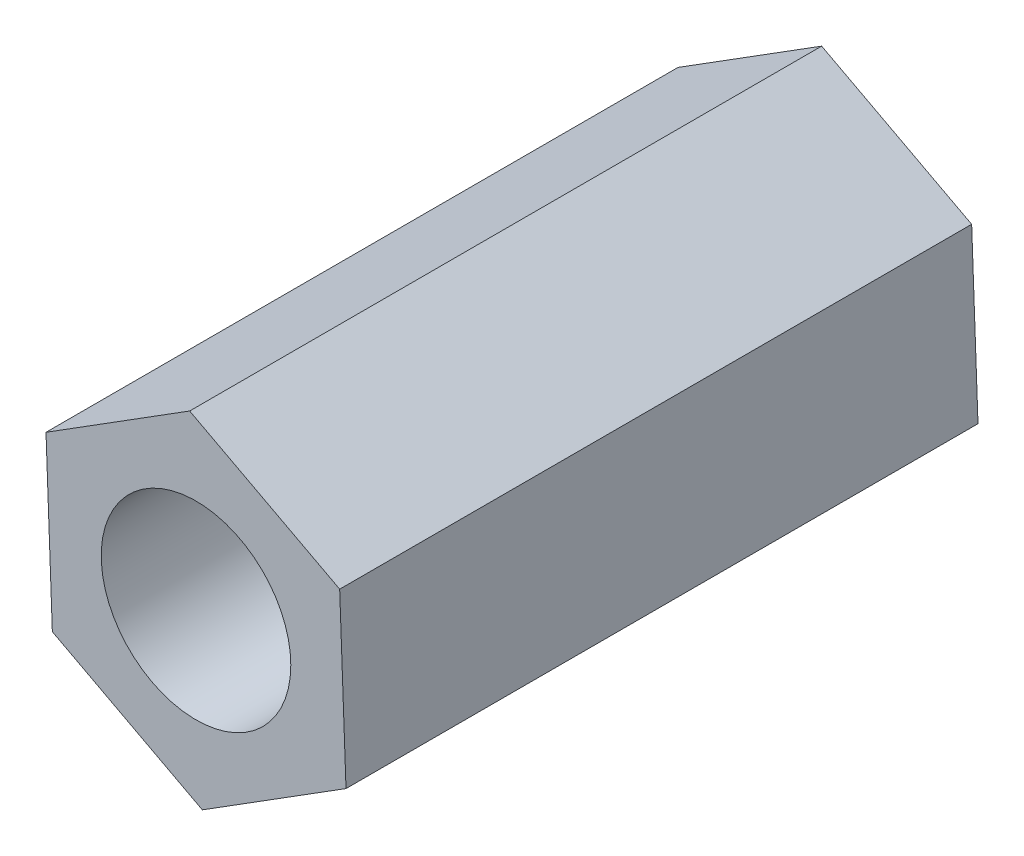
ISO-10303-21;
HEADER;
FILE_DESCRIPTION(('STEP AP214'),'2;1');
FILE_NAME('part.step','',(''),(''),'','','');
FILE_SCHEMA(('AUTOMOTIVE_DESIGN { 1 0 10303 214 1 1 1 1 }'));
ENDSEC;
DATA;
#1=APPLICATION_CONTEXT('core data for automotive mechanical design processes');
#2=APPLICATION_PROTOCOL_DEFINITION('international standard','automotive_design',2000,#1);
#3=PRODUCT_CONTEXT('',#1,'mechanical');
#4=PRODUCT('Part','Part','',(#3));
#5=PRODUCT_RELATED_PRODUCT_CATEGORY('part','',(#4));
#6=PRODUCT_DEFINITION_FORMATION('','',#4);
#7=PRODUCT_DEFINITION_CONTEXT('part definition',#1,'design');
#8=PRODUCT_DEFINITION('design','',#6,#7);
#9=PRODUCT_DEFINITION_SHAPE('','',#8);
#10=(LENGTH_UNIT() NAMED_UNIT(*) SI_UNIT(.MILLI.,.METRE.));
#11=(NAMED_UNIT(*) PLANE_ANGLE_UNIT() SI_UNIT($,.RADIAN.));
#12=(NAMED_UNIT(*) SI_UNIT($,.STERADIAN.) SOLID_ANGLE_UNIT());
#13=UNCERTAINTY_MEASURE_WITH_UNIT(LENGTH_MEASURE(1.E-05),#10,'distance_accuracy_value','');
#14=(GEOMETRIC_REPRESENTATION_CONTEXT(3) GLOBAL_UNCERTAINTY_ASSIGNED_CONTEXT((#13)) GLOBAL_UNIT_ASSIGNED_CONTEXT((#10,
#11,#12)) REPRESENTATION_CONTEXT('',''));
#15=CARTESIAN_POINT('',(0.,0.,0.));
#16=DIRECTION('',(0.,0.,1.));
#17=DIRECTION('',(1.,0.,0.));
#18=AXIS2_PLACEMENT_3D('',#15,#16,#17);
#19=CARTESIAN_POINT('',(0.,0.,10.));
#20=DIRECTION('',(0.,0.,1.));
#21=DIRECTION('',(1.,0.,0.));
#22=AXIS2_PLACEMENT_3D('',#19,#20,#21);
#23=PLANE('',#22);
#24=DIRECTION('',(-0.0373746720524852,0.999301322869618,0.));
#25=VECTOR('',#24,1.);
#26=CARTESIAN_POINT('',(2.37354506962798,-1.25450540152072,10.));
#27=LINE('',#26,#25);
#28=CARTESIAN_POINT('',(2.37354506962798,-1.25450540152072,10.));
#29=VERTEX_POINT('',#28);
#30=CARTESIAN_POINT('',(2.27320608171573,1.42829762656477,10.));
#31=VERTEX_POINT('',#30);
#32=EDGE_CURVE('E131',#29,#31,#27,.T.);
#33=ORIENTED_EDGE('',*,*,#32,.T.);
#34=DIRECTION('',(-0.884107667666727,0.467283245979245,0.));
#35=VECTOR('',#34,1.);
#36=CARTESIAN_POINT('',(2.27320608171573,1.42829762656477,10.));
#37=LINE('',#36,#35);
#38=CARTESIAN_POINT('',(-0.100338987912251,2.68280302808549,10.));
#39=VERTEX_POINT('',#38);
#40=EDGE_CURVE('E89',#31,#39,#37,.T.);
#41=ORIENTED_EDGE('',*,*,#40,.T.);
#42=DIRECTION('',(-0.846732995614242,-0.532018076890375,0.));
#43=VECTOR('',#42,1.);
#44=CARTESIAN_POINT('',(-0.100338987912251,2.68280302808549,10.));
#45=LINE('',#44,#43);
#46=CARTESIAN_POINT('',(-2.37354506962798,1.25450540152072,10.));
#47=VERTEX_POINT('',#46);
#48=EDGE_CURVE('E102',#39,#47,#45,.T.);
#49=ORIENTED_EDGE('',*,*,#48,.T.);
#50=DIRECTION('',(0.0373746720524864,-0.999301322869618,0.));
#51=VECTOR('',#50,1.);
#52=CARTESIAN_POINT('',(-2.37354506962798,1.25450540152072,10.));
#53=LINE('',#52,#51);
#54=CARTESIAN_POINT('',(-2.27320608171573,-1.42829762656478,10.));
#55=VERTEX_POINT('',#54);
#56=EDGE_CURVE('E96',#47,#55,#53,.T.);
#57=ORIENTED_EDGE('',*,*,#56,.T.);
#58=DIRECTION('',(0.884107667666728,-0.467283245979244,0.));
#59=VECTOR('',#58,1.);
#60=CARTESIAN_POINT('',(-2.27320608171573,-1.42829762656478,10.));
#61=LINE('',#60,#59);
#62=CARTESIAN_POINT('',(0.100338987912251,-2.68280302808549,10.));
#63=VERTEX_POINT('',#62);
#64=EDGE_CURVE('E100',#55,#63,#61,.T.);
#65=ORIENTED_EDGE('',*,*,#64,.T.);
#66=DIRECTION('',(0.846732995614242,0.532018076890374,0.));
#67=VECTOR('',#66,1.);
#68=CARTESIAN_POINT('',(0.100338987912251,-2.68280302808549,10.));
#69=LINE('',#68,#67);
#70=EDGE_CURVE('E52',#63,#29,#69,.T.);
#71=ORIENTED_EDGE('',*,*,#70,.T.);
#72=EDGE_LOOP('',(#33,#41,#49,#57,#65,#71));
#73=FACE_BOUND('',#72,.T.);
#74=CARTESIAN_POINT('',(0.,0.,10.));
#75=DIRECTION('',(0.,0.,1.));
#76=DIRECTION('',(1.,0.,0.));
#77=AXIS2_PLACEMENT_3D('',#74,#75,#76);
#78=CIRCLE('',#77,1.5);
#79=CARTESIAN_POINT('',(1.5,0.,10.));
#80=VERTEX_POINT('',#79);
#81=EDGE_CURVE('E124',#80,#80,#78,.T.);
#82=ORIENTED_EDGE('',*,*,#81,.F.);
#83=EDGE_LOOP('',(#82));
#84=FACE_BOUND('',#83,.T.);
#85=ADVANCED_FACE('F35',(#73,#84),#23,.T.);
#86=CARTESIAN_POINT('',(0.,0.,0.));
#87=DIRECTION('',(0.,0.,1.));
#88=DIRECTION('',(1.,0.,0.));
#89=AXIS2_PLACEMENT_3D('',#86,#87,#88);
#90=PLANE('',#89);
#91=DIRECTION('',(-0.0373746720524852,0.999301322869618,0.));
#92=VECTOR('',#91,1.);
#93=CARTESIAN_POINT('',(2.37354506962798,-1.25450540152072,0.));
#94=LINE('',#93,#92);
#95=CARTESIAN_POINT('',(2.37354506962798,-1.25450540152072,0.));
#96=VERTEX_POINT('',#95);
#97=CARTESIAN_POINT('',(2.27320608171573,1.42829762656477,0.));
#98=VERTEX_POINT('',#97);
#99=EDGE_CURVE('E120',#96,#98,#94,.T.);
#100=ORIENTED_EDGE('',*,*,#99,.F.);
#101=DIRECTION('',(0.846732995614242,0.532018076890374,0.));
#102=VECTOR('',#101,1.);
#103=CARTESIAN_POINT('',(0.100338987912251,-2.68280302808549,0.));
#104=LINE('',#103,#102);
#105=CARTESIAN_POINT('',(0.100338987912251,-2.68280302808549,0.));
#106=VERTEX_POINT('',#105);
#107=EDGE_CURVE('E81',#106,#96,#104,.T.);
#108=ORIENTED_EDGE('',*,*,#107,.F.);
#109=DIRECTION('',(0.884107667666728,-0.467283245979244,0.));
#110=VECTOR('',#109,1.);
#111=CARTESIAN_POINT('',(-2.27320608171573,-1.42829762656478,0.));
#112=LINE('',#111,#110);
#113=CARTESIAN_POINT('',(-2.27320608171573,-1.42829762656478,0.));
#114=VERTEX_POINT('',#113);
#115=EDGE_CURVE('E75',#114,#106,#112,.T.);
#116=ORIENTED_EDGE('',*,*,#115,.F.);
#117=DIRECTION('',(0.0373746720524864,-0.999301322869618,0.));
#118=VECTOR('',#117,1.);
#119=CARTESIAN_POINT('',(-2.37354506962798,1.25450540152072,0.));
#120=LINE('',#119,#118);
#121=CARTESIAN_POINT('',(-2.37354506962798,1.25450540152072,0.));
#122=VERTEX_POINT('',#121);
#123=EDGE_CURVE('E110',#122,#114,#120,.T.);
#124=ORIENTED_EDGE('',*,*,#123,.F.);
#125=DIRECTION('',(-0.846732995614242,-0.532018076890375,0.));
#126=VECTOR('',#125,1.);
#127=CARTESIAN_POINT('',(-0.100338987912251,2.68280302808549,0.));
#128=LINE('',#127,#126);
#129=CARTESIAN_POINT('',(-0.100338987912251,2.68280302808549,0.));
#130=VERTEX_POINT('',#129);
#131=EDGE_CURVE('E126',#130,#122,#128,.T.);
#132=ORIENTED_EDGE('',*,*,#131,.F.);
#133=DIRECTION('',(-0.884107667666727,0.467283245979245,0.));
#134=VECTOR('',#133,1.);
#135=CARTESIAN_POINT('',(2.27320608171573,1.42829762656477,0.));
#136=LINE('',#135,#134);
#137=EDGE_CURVE('E123',#98,#130,#136,.T.);
#138=ORIENTED_EDGE('',*,*,#137,.F.);
#139=EDGE_LOOP('',(#100,#108,#116,#124,#132,#138));
#140=FACE_BOUND('',#139,.T.);
#141=CARTESIAN_POINT('',(0.,0.,0.));
#142=DIRECTION('',(0.,0.,1.));
#143=DIRECTION('',(1.,0.,0.));
#144=AXIS2_PLACEMENT_3D('',#141,#142,#143);
#145=CIRCLE('',#144,1.5);
#146=CARTESIAN_POINT('',(1.5,0.,0.));
#147=VERTEX_POINT('',#146);
#148=EDGE_CURVE('E224',#147,#147,#145,.T.);
#149=ORIENTED_EDGE('',*,*,#148,.T.);
#150=EDGE_LOOP('',(#149));
#151=FACE_BOUND('',#150,.T.);
#152=ADVANCED_FACE('F140',(#140,#151),#90,.F.);
#153=CARTESIAN_POINT('',(2.37354506962798,-1.25450540152072,10.));
#154=DIRECTION('',(-0.999301322869618,-0.0373746720524852,0.));
#155=DIRECTION('',(0.0373746720524852,-0.999301322869618,0.));
#156=AXIS2_PLACEMENT_3D('',#153,#154,#155);
#157=PLANE('',#156);
#158=ORIENTED_EDGE('',*,*,#99,.T.);
#159=DIRECTION('',(0.,0.,-1.));
#160=VECTOR('',#159,1.);
#161=CARTESIAN_POINT('',(2.27320608171573,1.42829762656477,10.));
#162=LINE('',#161,#160);
#163=EDGE_CURVE('E11',#31,#98,#162,.T.);
#164=ORIENTED_EDGE('',*,*,#163,.F.);
#165=ORIENTED_EDGE('',*,*,#32,.F.);
#166=DIRECTION('',(0.,0.,-1.));
#167=VECTOR('',#166,1.);
#168=CARTESIAN_POINT('',(2.37354506962798,-1.25450540152072,10.));
#169=LINE('',#168,#167);
#170=EDGE_CURVE('E116',#29,#96,#169,.T.);
#171=ORIENTED_EDGE('',*,*,#170,.T.);
#172=EDGE_LOOP('',(#158,#164,#165,#171));
#173=FACE_BOUND('',#172,.T.);
#174=ADVANCED_FACE('F37',(#173),#157,.F.);
#175=CARTESIAN_POINT('',(2.27320608171573,1.42829762656477,10.));
#176=DIRECTION('',(-0.467283245979245,-0.884107667666727,0.));
#177=DIRECTION('',(0.884107667666727,-0.467283245979245,0.));
#178=AXIS2_PLACEMENT_3D('',#175,#176,#177);
#179=PLANE('',#178);
#180=ORIENTED_EDGE('',*,*,#137,.T.);
#181=DIRECTION('',(0.,0.,-1.));
#182=VECTOR('',#181,1.);
#183=CARTESIAN_POINT('',(-0.100338987912251,2.68280302808549,10.));
#184=LINE('',#183,#182);
#185=EDGE_CURVE('E44',#39,#130,#184,.T.);
#186=ORIENTED_EDGE('',*,*,#185,.F.);
#187=ORIENTED_EDGE('',*,*,#40,.F.);
#188=ORIENTED_EDGE('',*,*,#163,.T.);
#189=EDGE_LOOP('',(#180,#186,#187,#188));
#190=FACE_BOUND('',#189,.T.);
#191=ADVANCED_FACE('F165',(#190),#179,.F.);
#192=CARTESIAN_POINT('',(-0.100338987912251,2.68280302808549,10.));
#193=DIRECTION('',(0.532018076890375,-0.846732995614242,0.));
#194=DIRECTION('',(0.846732995614242,0.532018076890375,0.));
#195=AXIS2_PLACEMENT_3D('',#192,#193,#194);
#196=PLANE('',#195);
#197=ORIENTED_EDGE('',*,*,#131,.T.);
#198=DIRECTION('',(0.,0.,-1.));
#199=VECTOR('',#198,1.);
#200=CARTESIAN_POINT('',(-2.37354506962798,1.25450540152072,10.));
#201=LINE('',#200,#199);
#202=EDGE_CURVE('E111',#47,#122,#201,.T.);
#203=ORIENTED_EDGE('',*,*,#202,.F.);
#204=ORIENTED_EDGE('',*,*,#48,.F.);
#205=ORIENTED_EDGE('',*,*,#185,.T.);
#206=EDGE_LOOP('',(#197,#203,#204,#205));
#207=FACE_BOUND('',#206,.T.);
#208=ADVANCED_FACE('F137',(#207),#196,.F.);
#209=CARTESIAN_POINT('',(-2.37354506962798,1.25450540152072,10.));
#210=DIRECTION('',(0.999301322869618,0.0373746720524864,0.));
#211=DIRECTION('',(-0.0373746720524864,0.999301322869618,0.));
#212=AXIS2_PLACEMENT_3D('',#209,#210,#211);
#213=PLANE('',#212);
#214=ORIENTED_EDGE('',*,*,#123,.T.);
#215=DIRECTION('',(0.,0.,-1.));
#216=VECTOR('',#215,1.);
#217=CARTESIAN_POINT('',(-2.27320608171573,-1.42829762656478,10.));
#218=LINE('',#217,#216);
#219=EDGE_CURVE('E107',#55,#114,#218,.T.);
#220=ORIENTED_EDGE('',*,*,#219,.F.);
#221=ORIENTED_EDGE('',*,*,#56,.F.);
#222=ORIENTED_EDGE('',*,*,#202,.T.);
#223=EDGE_LOOP('',(#214,#220,#221,#222));
#224=FACE_BOUND('',#223,.T.);
#225=ADVANCED_FACE('F108',(#224),#213,.F.);
#226=CARTESIAN_POINT('',(-2.27320608171573,-1.42829762656478,10.));
#227=DIRECTION('',(0.467283245979244,0.884107667666728,0.));
#228=DIRECTION('',(-0.884107667666728,0.467283245979244,0.));
#229=AXIS2_PLACEMENT_3D('',#226,#227,#228);
#230=PLANE('',#229);
#231=ORIENTED_EDGE('',*,*,#115,.T.);
#232=DIRECTION('',(0.,0.,-1.));
#233=VECTOR('',#232,1.);
#234=CARTESIAN_POINT('',(0.100338987912251,-2.68280302808549,10.));
#235=LINE('',#234,#233);
#236=EDGE_CURVE('E112',#63,#106,#235,.T.);
#237=ORIENTED_EDGE('',*,*,#236,.F.);
#238=ORIENTED_EDGE('',*,*,#64,.F.);
#239=ORIENTED_EDGE('',*,*,#219,.T.);
#240=EDGE_LOOP('',(#231,#237,#238,#239));
#241=FACE_BOUND('',#240,.T.);
#242=ADVANCED_FACE('F114',(#241),#230,.F.);
#243=CARTESIAN_POINT('',(0.100338987912251,-2.68280302808549,10.));
#244=DIRECTION('',(-0.532018076890374,0.846732995614242,0.));
#245=DIRECTION('',(-0.846732995614242,-0.532018076890375,0.));
#246=AXIS2_PLACEMENT_3D('',#243,#244,#245);
#247=PLANE('',#246);
#248=ORIENTED_EDGE('',*,*,#107,.T.);
#249=ORIENTED_EDGE('',*,*,#170,.F.);
#250=ORIENTED_EDGE('',*,*,#70,.F.);
#251=ORIENTED_EDGE('',*,*,#236,.T.);
#252=EDGE_LOOP('',(#248,#249,#250,#251));
#253=FACE_BOUND('',#252,.T.);
#254=ADVANCED_FACE('F145',(#253),#247,.F.);
#255=CARTESIAN_POINT('',(0.,0.,10.));
#256=DIRECTION('',(0.,0.,-1.));
#257=DIRECTION('',(-1.,0.,0.));
#258=AXIS2_PLACEMENT_3D('',#255,#256,#257);
#259=CYLINDRICAL_SURFACE('',#258,1.5);
#260=ORIENTED_EDGE('',*,*,#81,.T.);
#261=EDGE_LOOP('',(#260));
#262=FACE_BOUND('',#261,.T.);
#263=ORIENTED_EDGE('',*,*,#148,.F.);
#264=EDGE_LOOP('',(#263));
#265=FACE_BOUND('',#264,.T.);
#266=ADVANCED_FACE('F147',(#262,#265),#259,.F.);
#267=CLOSED_SHELL('',(#85,#152,#174,#191,#208,#225,#242,#254,#266));
#268=MANIFOLD_SOLID_BREP('B2',#267);
#269=ADVANCED_BREP_SHAPE_REPRESENTATION('',(#18,#268),#14);
#270=SHAPE_DEFINITION_REPRESENTATION(#9,#269);
ENDSEC;
END-ISO-10303-21;
